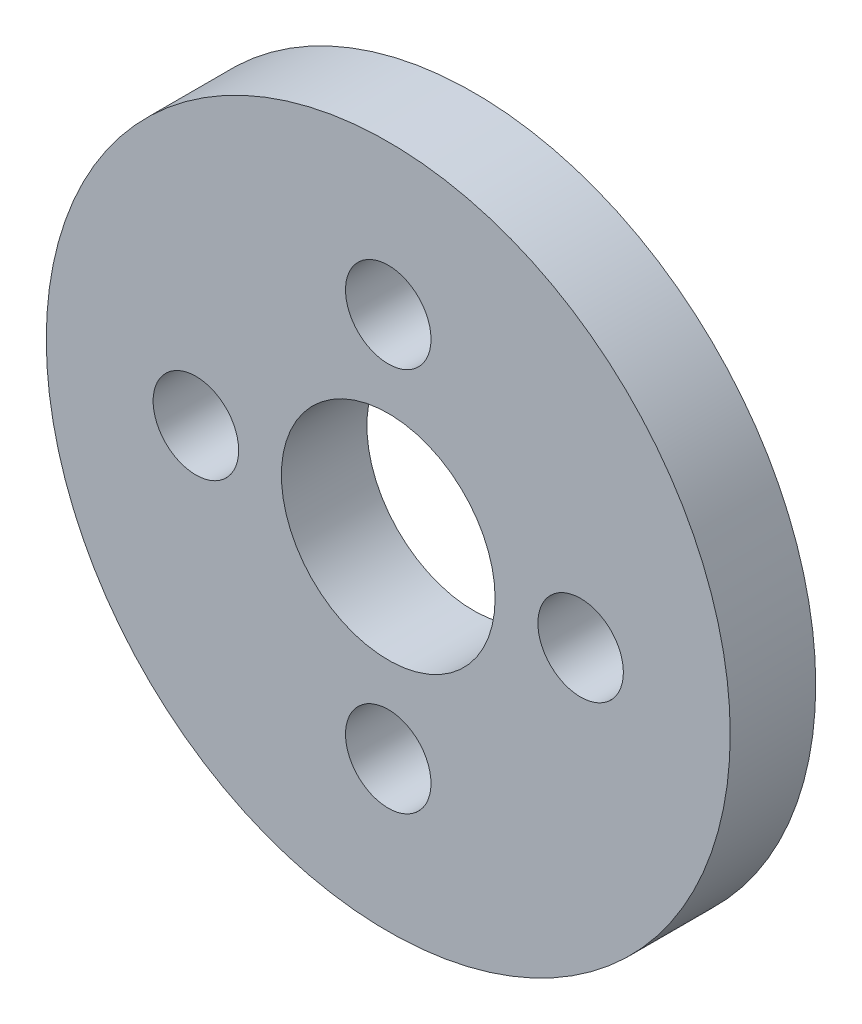
ISO-10303-21;
HEADER;
FILE_DESCRIPTION(('STEP AP214'),'2;1');
FILE_NAME('part.step','',(''),(''),'','','');
FILE_SCHEMA(('AUTOMOTIVE_DESIGN { 1 0 10303 214 1 1 1 1 }'));
ENDSEC;
DATA;
#1=APPLICATION_CONTEXT('core data for automotive mechanical design processes');
#2=APPLICATION_PROTOCOL_DEFINITION('international standard','automotive_design',2000,#1);
#3=PRODUCT_CONTEXT('',#1,'mechanical');
#4=PRODUCT('Part','Part','',(#3));
#5=PRODUCT_RELATED_PRODUCT_CATEGORY('part','',(#4));
#6=PRODUCT_DEFINITION_FORMATION('','',#4);
#7=PRODUCT_DEFINITION_CONTEXT('part definition',#1,'design');
#8=PRODUCT_DEFINITION('design','',#6,#7);
#9=PRODUCT_DEFINITION_SHAPE('','',#8);
#10=(LENGTH_UNIT() NAMED_UNIT(*) SI_UNIT(.MILLI.,.METRE.));
#11=(NAMED_UNIT(*) PLANE_ANGLE_UNIT() SI_UNIT($,.RADIAN.));
#12=(NAMED_UNIT(*) SI_UNIT($,.STERADIAN.) SOLID_ANGLE_UNIT());
#13=UNCERTAINTY_MEASURE_WITH_UNIT(LENGTH_MEASURE(1.E-05),#10,'distance_accuracy_value','');
#14=(GEOMETRIC_REPRESENTATION_CONTEXT(3) GLOBAL_UNCERTAINTY_ASSIGNED_CONTEXT((#13)) GLOBAL_UNIT_ASSIGNED_CONTEXT((#10,
#11,#12)) REPRESENTATION_CONTEXT('',''));
#15=CARTESIAN_POINT('',(0.,0.,0.));
#16=DIRECTION('',(0.,0.,1.));
#17=DIRECTION('',(1.,0.,0.));
#18=AXIS2_PLACEMENT_3D('',#15,#16,#17);
#19=CARTESIAN_POINT('',(-2.27794996185915E-11,228.600000000015,6.35));
#20=DIRECTION('',(0.,0.,1.));
#21=DIRECTION('',(1.,0.,0.));
#22=AXIS2_PLACEMENT_3D('',#19,#20,#21);
#23=PLANE('',#22);
#24=CARTESIAN_POINT('',(-3.99826880878935E-11,214.312500000015,6.35));
#25=DIRECTION('',(0.,0.,1.));
#26=DIRECTION('',(1.,0.,0.));
#27=AXIS2_PLACEMENT_3D('',#24,#25,#26);
#28=CIRCLE('',#27,3.175);
#29=CARTESIAN_POINT('',(3.17499999996001,214.312500000015,6.35));
#30=VERTEX_POINT('',#29);
#31=EDGE_CURVE('E61',#30,#30,#28,.T.);
#32=ORIENTED_EDGE('',*,*,#31,.F.);
#33=EDGE_LOOP('',(#32));
#34=FACE_BOUND('',#33,.T.);
#35=CARTESIAN_POINT('',(-5.57456143517531E-12,242.887500000015,6.35));
#36=DIRECTION('',(0.,0.,1.));
#37=DIRECTION('',(1.,0.,0.));
#38=AXIS2_PLACEMENT_3D('',#35,#36,#37);
#39=CIRCLE('',#38,3.175);
#40=CARTESIAN_POINT('',(3.17499999999442,242.887500000015,6.35));
#41=VERTEX_POINT('',#40);
#42=EDGE_CURVE('E49',#41,#41,#39,.T.);
#43=ORIENTED_EDGE('',*,*,#42,.F.);
#44=EDGE_LOOP('',(#43));
#45=FACE_BOUND('',#44,.T.);
#46=CARTESIAN_POINT('',(-2.27794996185915E-11,228.600000000015,6.35));
#47=DIRECTION('',(0.,0.,1.));
#48=DIRECTION('',(1.,0.,0.));
#49=AXIS2_PLACEMENT_3D('',#46,#47,#48);
#50=CIRCLE('',#49,25.400000000019);
#51=CARTESIAN_POINT('',(25.3999999999962,228.600000000015,6.35));
#52=VERTEX_POINT('',#51);
#53=EDGE_CURVE('E10',#52,#52,#50,.T.);
#54=ORIENTED_EDGE('',*,*,#53,.T.);
#55=EDGE_LOOP('',(#54));
#56=FACE_BOUND('',#55,.T.);
#57=CARTESIAN_POINT('',(-2.27794996185915E-11,228.600000000015,6.35));
#58=DIRECTION('',(0.,0.,1.));
#59=DIRECTION('',(1.,0.,0.));
#60=AXIS2_PLACEMENT_3D('',#57,#58,#59);
#61=CIRCLE('',#60,7.9375);
#62=CARTESIAN_POINT('',(7.93749999997722,228.600000000015,6.35));
#63=VERTEX_POINT('',#62);
#64=EDGE_CURVE('E44',#63,#63,#61,.T.);
#65=ORIENTED_EDGE('',*,*,#64,.F.);
#66=EDGE_LOOP('',(#65));
#67=FACE_BOUND('',#66,.T.);
#68=CARTESIAN_POINT('',(14.2874999999772,228.599999999998,6.35));
#69=DIRECTION('',(0.,0.,1.));
#70=DIRECTION('',(1.,0.,0.));
#71=AXIS2_PLACEMENT_3D('',#68,#69,#70);
#72=CIRCLE('',#71,3.175);
#73=CARTESIAN_POINT('',(17.4624999999772,228.599999999998,6.35));
#74=VERTEX_POINT('',#73);
#75=EDGE_CURVE('E55',#74,#74,#72,.T.);
#76=ORIENTED_EDGE('',*,*,#75,.F.);
#77=EDGE_LOOP('',(#76));
#78=FACE_BOUND('',#77,.T.);
#79=CARTESIAN_POINT('',(-14.2875000000228,228.600000000032,6.35));
#80=DIRECTION('',(0.,0.,1.));
#81=DIRECTION('',(1.,0.,0.));
#82=AXIS2_PLACEMENT_3D('',#79,#80,#81);
#83=CIRCLE('',#82,3.175);
#84=CARTESIAN_POINT('',(-11.1125000000228,228.600000000032,6.35));
#85=VERTEX_POINT('',#84);
#86=EDGE_CURVE('E67',#85,#85,#83,.T.);
#87=ORIENTED_EDGE('',*,*,#86,.F.);
#88=EDGE_LOOP('',(#87));
#89=FACE_BOUND('',#88,.T.);
#90=ADVANCED_FACE('F33',(#34,#45,#56,#67,#78,#89),#23,.T.);
#91=CARTESIAN_POINT('',(-2.27794996185915E-11,228.600000000015,0.));
#92=DIRECTION('',(0.,0.,1.));
#93=DIRECTION('',(1.,0.,0.));
#94=AXIS2_PLACEMENT_3D('',#91,#92,#93);
#95=PLANE('',#94);
#96=CARTESIAN_POINT('',(-2.27794996185915E-11,228.600000000015,0.));
#97=DIRECTION('',(0.,0.,1.));
#98=DIRECTION('',(1.,0.,0.));
#99=AXIS2_PLACEMENT_3D('',#96,#97,#98);
#100=CIRCLE('',#99,25.400000000019);
#101=CARTESIAN_POINT('',(25.3999999999962,228.600000000015,0.));
#102=VERTEX_POINT('',#101);
#103=EDGE_CURVE('E37',#102,#102,#100,.T.);
#104=ORIENTED_EDGE('',*,*,#103,.F.);
#105=EDGE_LOOP('',(#104));
#106=FACE_BOUND('',#105,.T.);
#107=CARTESIAN_POINT('',(-2.27794996185915E-11,228.600000000015,0.));
#108=DIRECTION('',(0.,0.,1.));
#109=DIRECTION('',(1.,0.,0.));
#110=AXIS2_PLACEMENT_3D('',#107,#108,#109);
#111=CIRCLE('',#110,7.9375);
#112=CARTESIAN_POINT('',(7.93749999997722,228.600000000015,0.));
#113=VERTEX_POINT('',#112);
#114=EDGE_CURVE('E46',#113,#113,#111,.T.);
#115=ORIENTED_EDGE('',*,*,#114,.T.);
#116=EDGE_LOOP('',(#115));
#117=FACE_BOUND('',#116,.T.);
#118=CARTESIAN_POINT('',(-5.57456143517531E-12,242.887500000015,0.));
#119=DIRECTION('',(0.,0.,1.));
#120=DIRECTION('',(1.,0.,0.));
#121=AXIS2_PLACEMENT_3D('',#118,#119,#120);
#122=CIRCLE('',#121,3.175);
#123=CARTESIAN_POINT('',(3.17499999999442,242.887500000015,0.));
#124=VERTEX_POINT('',#123);
#125=EDGE_CURVE('E52',#124,#124,#122,.T.);
#126=ORIENTED_EDGE('',*,*,#125,.T.);
#127=EDGE_LOOP('',(#126));
#128=FACE_BOUND('',#127,.T.);
#129=CARTESIAN_POINT('',(14.2874999999772,228.599999999998,0.));
#130=DIRECTION('',(0.,0.,1.));
#131=DIRECTION('',(1.,0.,0.));
#132=AXIS2_PLACEMENT_3D('',#129,#130,#131);
#133=CIRCLE('',#132,3.175);
#134=CARTESIAN_POINT('',(17.4624999999772,228.599999999998,0.));
#135=VERTEX_POINT('',#134);
#136=EDGE_CURVE('E58',#135,#135,#133,.T.);
#137=ORIENTED_EDGE('',*,*,#136,.T.);
#138=EDGE_LOOP('',(#137));
#139=FACE_BOUND('',#138,.T.);
#140=CARTESIAN_POINT('',(-3.99826880878935E-11,214.312500000015,0.));
#141=DIRECTION('',(0.,0.,1.));
#142=DIRECTION('',(1.,0.,0.));
#143=AXIS2_PLACEMENT_3D('',#140,#141,#142);
#144=CIRCLE('',#143,3.175);
#145=CARTESIAN_POINT('',(3.17499999996001,214.312500000015,0.));
#146=VERTEX_POINT('',#145);
#147=EDGE_CURVE('E64',#146,#146,#144,.T.);
#148=ORIENTED_EDGE('',*,*,#147,.T.);
#149=EDGE_LOOP('',(#148));
#150=FACE_BOUND('',#149,.T.);
#151=CARTESIAN_POINT('',(-14.2875000000228,228.600000000032,0.));
#152=DIRECTION('',(0.,0.,1.));
#153=DIRECTION('',(1.,0.,0.));
#154=AXIS2_PLACEMENT_3D('',#151,#152,#153);
#155=CIRCLE('',#154,3.175);
#156=CARTESIAN_POINT('',(-11.1125000000228,228.600000000032,0.));
#157=VERTEX_POINT('',#156);
#158=EDGE_CURVE('E70',#157,#157,#155,.T.);
#159=ORIENTED_EDGE('',*,*,#158,.T.);
#160=EDGE_LOOP('',(#159));
#161=FACE_BOUND('',#160,.T.);
#162=ADVANCED_FACE('F80',(#106,#117,#128,#139,#150,#161),#95,.F.);
#163=CARTESIAN_POINT('',(-2.27794996185915E-11,228.600000000015,6.35));
#164=DIRECTION('',(0.,0.,-1.));
#165=DIRECTION('',(-1.,0.,0.));
#166=AXIS2_PLACEMENT_3D('',#163,#164,#165);
#167=CYLINDRICAL_SURFACE('',#166,25.400000000019);
#168=ORIENTED_EDGE('',*,*,#53,.F.);
#169=EDGE_LOOP('',(#168));
#170=FACE_BOUND('',#169,.T.);
#171=ORIENTED_EDGE('',*,*,#103,.T.);
#172=EDGE_LOOP('',(#171));
#173=FACE_BOUND('',#172,.T.);
#174=ADVANCED_FACE('F35',(#170,#173),#167,.T.);
#175=CARTESIAN_POINT('',(-2.27794996185915E-11,228.600000000015,6.35));
#176=DIRECTION('',(0.,0.,-1.));
#177=DIRECTION('',(-1.,0.,0.));
#178=AXIS2_PLACEMENT_3D('',#175,#176,#177);
#179=CYLINDRICAL_SURFACE('',#178,7.9375);
#180=ORIENTED_EDGE('',*,*,#64,.T.);
#181=EDGE_LOOP('',(#180));
#182=FACE_BOUND('',#181,.T.);
#183=ORIENTED_EDGE('',*,*,#114,.F.);
#184=EDGE_LOOP('',(#183));
#185=FACE_BOUND('',#184,.T.);
#186=ADVANCED_FACE('F90',(#182,#185),#179,.F.);
#187=CARTESIAN_POINT('',(-5.57456143517531E-12,242.887500000015,6.35));
#188=DIRECTION('',(0.,0.,-1.));
#189=DIRECTION('',(-1.,0.,0.));
#190=AXIS2_PLACEMENT_3D('',#187,#188,#189);
#191=CYLINDRICAL_SURFACE('',#190,3.175);
#192=ORIENTED_EDGE('',*,*,#42,.T.);
#193=EDGE_LOOP('',(#192));
#194=FACE_BOUND('',#193,.T.);
#195=ORIENTED_EDGE('',*,*,#125,.F.);
#196=EDGE_LOOP('',(#195));
#197=FACE_BOUND('',#196,.T.);
#198=ADVANCED_FACE('F93',(#194,#197),#191,.F.);
#199=CARTESIAN_POINT('',(14.2874999999772,228.599999999998,6.35));
#200=DIRECTION('',(0.,0.,-1.));
#201=DIRECTION('',(-1.,0.,0.));
#202=AXIS2_PLACEMENT_3D('',#199,#200,#201);
#203=CYLINDRICAL_SURFACE('',#202,3.175);
#204=ORIENTED_EDGE('',*,*,#75,.T.);
#205=EDGE_LOOP('',(#204));
#206=FACE_BOUND('',#205,.T.);
#207=ORIENTED_EDGE('',*,*,#136,.F.);
#208=EDGE_LOOP('',(#207));
#209=FACE_BOUND('',#208,.T.);
#210=ADVANCED_FACE('F97',(#206,#209),#203,.F.);
#211=CARTESIAN_POINT('',(-3.99826880878935E-11,214.312500000015,6.35));
#212=DIRECTION('',(0.,0.,-1.));
#213=DIRECTION('',(-1.,0.,0.));
#214=AXIS2_PLACEMENT_3D('',#211,#212,#213);
#215=CYLINDRICAL_SURFACE('',#214,3.175);
#216=ORIENTED_EDGE('',*,*,#31,.T.);
#217=EDGE_LOOP('',(#216));
#218=FACE_BOUND('',#217,.T.);
#219=ORIENTED_EDGE('',*,*,#147,.F.);
#220=EDGE_LOOP('',(#219));
#221=FACE_BOUND('',#220,.T.);
#222=ADVANCED_FACE('F101',(#218,#221),#215,.F.);
#223=CARTESIAN_POINT('',(-14.2875000000228,228.600000000032,6.35));
#224=DIRECTION('',(0.,0.,-1.));
#225=DIRECTION('',(-1.,0.,0.));
#226=AXIS2_PLACEMENT_3D('',#223,#224,#225);
#227=CYLINDRICAL_SURFACE('',#226,3.175);
#228=ORIENTED_EDGE('',*,*,#86,.T.);
#229=EDGE_LOOP('',(#228));
#230=FACE_BOUND('',#229,.T.);
#231=ORIENTED_EDGE('',*,*,#158,.F.);
#232=EDGE_LOOP('',(#231));
#233=FACE_BOUND('',#232,.T.);
#234=ADVANCED_FACE('F76',(#230,#233),#227,.F.);
#235=CLOSED_SHELL('',(#90,#162,#174,#186,#198,#210,#222,#234));
#236=MANIFOLD_SOLID_BREP('B2',#235);
#237=ADVANCED_BREP_SHAPE_REPRESENTATION('',(#18,#236),#14);
#238=SHAPE_DEFINITION_REPRESENTATION(#9,#237);
ENDSEC;
END-ISO-10303-21;
